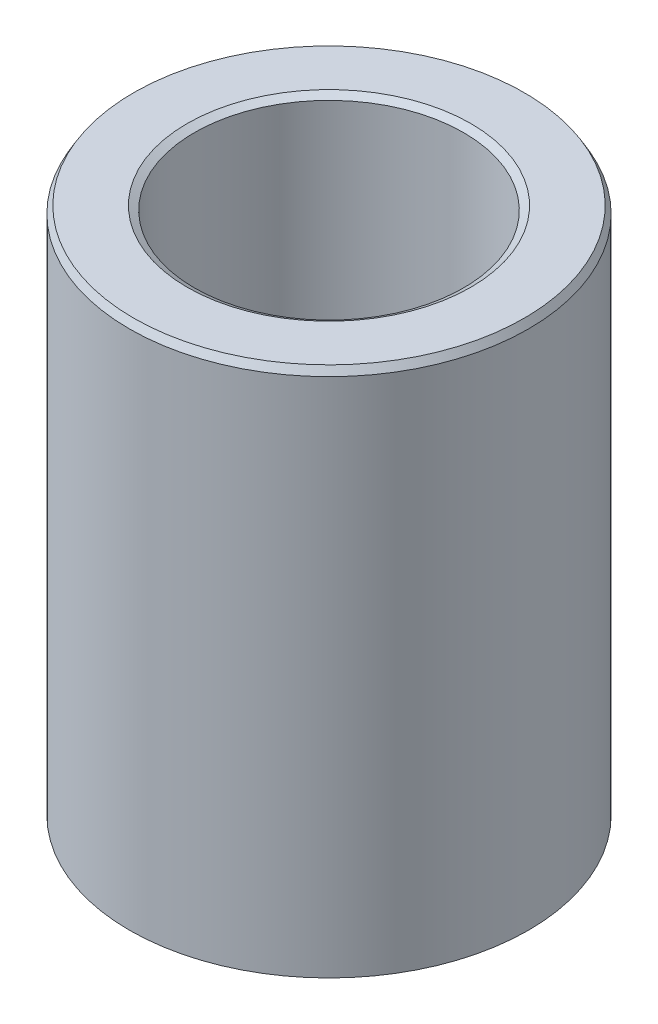
ISO-10303-21;
HEADER;
FILE_DESCRIPTION(('STEP AP214'),'2;1');
FILE_NAME('part.step','',(''),(''),'','','');
FILE_SCHEMA(('AUTOMOTIVE_DESIGN { 1 0 10303 214 1 1 1 1 }'));
ENDSEC;
DATA;
#1=APPLICATION_CONTEXT('core data for automotive mechanical design processes');
#2=APPLICATION_PROTOCOL_DEFINITION('international standard','automotive_design',2000,#1);
#3=PRODUCT_CONTEXT('',#1,'mechanical');
#4=PRODUCT('Part','Part','',(#3));
#5=PRODUCT_RELATED_PRODUCT_CATEGORY('part','',(#4));
#6=PRODUCT_DEFINITION_FORMATION('','',#4);
#7=PRODUCT_DEFINITION_CONTEXT('part definition',#1,'design');
#8=PRODUCT_DEFINITION('design','',#6,#7);
#9=PRODUCT_DEFINITION_SHAPE('','',#8);
#10=(LENGTH_UNIT() NAMED_UNIT(*) SI_UNIT(.MILLI.,.METRE.));
#11=(NAMED_UNIT(*) PLANE_ANGLE_UNIT() SI_UNIT($,.RADIAN.));
#12=(NAMED_UNIT(*) SI_UNIT($,.STERADIAN.) SOLID_ANGLE_UNIT());
#13=UNCERTAINTY_MEASURE_WITH_UNIT(LENGTH_MEASURE(1.E-05),#10,'distance_accuracy_value','');
#14=(GEOMETRIC_REPRESENTATION_CONTEXT(3) GLOBAL_UNCERTAINTY_ASSIGNED_CONTEXT((#13)) GLOBAL_UNIT_ASSIGNED_CONTEXT((#10,
#11,#12)) REPRESENTATION_CONTEXT('',''));
#15=CARTESIAN_POINT('',(0.,0.,0.));
#16=DIRECTION('',(0.,0.,1.));
#17=DIRECTION('',(1.,0.,0.));
#18=AXIS2_PLACEMENT_3D('',#15,#16,#17);
#19=CARTESIAN_POINT('',(0.,20.0076575660146,0.));
#20=DIRECTION('',(0.,-1.,0.));
#21=DIRECTION('',(0.,0.,-1.));
#22=AXIS2_PLACEMENT_3D('',#19,#20,#21);
#23=CYLINDRICAL_SURFACE('',#22,7.5);
#24=CARTESIAN_POINT('',(0.,0.157490835188026,0.));
#25=DIRECTION('',(0.,1.,0.));
#26=DIRECTION('',(0.,0.,1.));
#27=AXIS2_PLACEMENT_3D('',#24,#25,#26);
#28=CIRCLE('',#27,7.5);
#29=CARTESIAN_POINT('',(0.,0.157490835188026,7.5));
#30=VERTEX_POINT('',#29);
#31=EDGE_CURVE('E10',#30,#30,#28,.T.);
#32=ORIENTED_EDGE('',*,*,#31,.T.);
#33=EDGE_LOOP('',(#32));
#34=FACE_BOUND('',#33,.T.);
#35=CARTESIAN_POINT('',(0.,19.7348754377425,0.));
#36=DIRECTION('',(0.,1.,0.));
#37=DIRECTION('',(0.,0.,1.));
#38=AXIS2_PLACEMENT_3D('',#35,#36,#37);
#39=CIRCLE('',#38,7.5);
#40=CARTESIAN_POINT('',(0.,19.7348754377425,7.5));
#41=VERTEX_POINT('',#40);
#42=EDGE_CURVE('E50',#41,#41,#39,.F.);
#43=ORIENTED_EDGE('',*,*,#42,.T.);
#44=EDGE_LOOP('',(#43));
#45=FACE_BOUND('',#44,.T.);
#46=ADVANCED_FACE('F39',(#34,#45),#23,.T.);
#47=CARTESIAN_POINT('',(0.,20.0076575660146,0.));
#48=DIRECTION('',(0.,1.,0.));
#49=DIRECTION('',(0.,0.,1.));
#50=AXIS2_PLACEMENT_3D('',#47,#48,#49);
#51=PLANE('',#50);
#52=CARTESIAN_POINT('',(0.,20.0076575660146,0.));
#53=DIRECTION('',(0.,1.,0.));
#54=DIRECTION('',(0.,0.,1.));
#55=AXIS2_PLACEMENT_3D('',#52,#53,#54);
#56=CIRCLE('',#55,5.33244626798489);
#57=CARTESIAN_POINT('',(0.,20.0076575660146,5.33244626798489));
#58=VERTEX_POINT('',#57);
#59=EDGE_CURVE('E58',#58,#58,#56,.F.);
#60=ORIENTED_EDGE('',*,*,#59,.T.);
#61=EDGE_LOOP('',(#60));
#62=FACE_BOUND('',#61,.T.);
#63=CARTESIAN_POINT('',(0.,20.0076575660146,0.));
#64=DIRECTION('',(0.,1.,0.));
#65=DIRECTION('',(0.,0.,1.));
#66=AXIS2_PLACEMENT_3D('',#63,#64,#65);
#67=CIRCLE('',#66,7.34250916481197);
#68=CARTESIAN_POINT('',(0.,20.0076575660146,7.34250916481197));
#69=VERTEX_POINT('',#68);
#70=EDGE_CURVE('E61',#69,#69,#67,.T.);
#71=ORIENTED_EDGE('',*,*,#70,.T.);
#72=EDGE_LOOP('',(#71));
#73=FACE_BOUND('',#72,.T.);
#74=ADVANCED_FACE('F88',(#62,#73),#51,.T.);
#75=CARTESIAN_POINT('',(0.,0.,0.));
#76=DIRECTION('',(0.,1.,0.));
#77=DIRECTION('',(0.,0.,1.));
#78=AXIS2_PLACEMENT_3D('',#75,#76,#77);
#79=PLANE('',#78);
#80=CARTESIAN_POINT('',(0.,0.,0.));
#81=DIRECTION('',(0.,1.,0.));
#82=DIRECTION('',(0.,0.,1.));
#83=AXIS2_PLACEMENT_3D('',#80,#81,#82);
#84=CIRCLE('',#83,5.2171549749008);
#85=CARTESIAN_POINT('',(0.,0.,5.2171549749008));
#86=VERTEX_POINT('',#85);
#87=EDGE_CURVE('E51',#86,#86,#84,.T.);
#88=ORIENTED_EDGE('',*,*,#87,.T.);
#89=EDGE_LOOP('',(#88));
#90=FACE_BOUND('',#89,.T.);
#91=CARTESIAN_POINT('',(0.,0.,0.));
#92=DIRECTION('',(0.,1.,0.));
#93=DIRECTION('',(0.,0.,1.));
#94=AXIS2_PLACEMENT_3D('',#91,#92,#93);
#95=CIRCLE('',#94,7.22721787172788);
#96=CARTESIAN_POINT('',(0.,0.,7.22721787172788));
#97=VERTEX_POINT('',#96);
#98=EDGE_CURVE('E54',#97,#97,#95,.F.);
#99=ORIENTED_EDGE('',*,*,#98,.T.);
#100=EDGE_LOOP('',(#99));
#101=FACE_BOUND('',#100,.T.);
#102=ADVANCED_FACE('F83',(#90,#101),#79,.F.);
#103=CARTESIAN_POINT('',(0.,20.0076575660146,0.));
#104=DIRECTION('',(0.,-1.,0.));
#105=DIRECTION('',(0.,0.,-1.));
#106=AXIS2_PLACEMENT_3D('',#103,#104,#105);
#107=CYLINDRICAL_SURFACE('',#106,5.05966413971277);
#108=CARTESIAN_POINT('',(0.,19.8501667308266,0.));
#109=DIRECTION('',(0.,1.,0.));
#110=DIRECTION('',(0.,0.,1.));
#111=AXIS2_PLACEMENT_3D('',#108,#109,#110);
#112=CIRCLE('',#111,5.05966413971277);
#113=CARTESIAN_POINT('',(0.,19.8501667308266,5.05966413971277));
#114=VERTEX_POINT('',#113);
#115=EDGE_CURVE('E67',#114,#114,#112,.T.);
#116=ORIENTED_EDGE('',*,*,#115,.T.);
#117=EDGE_LOOP('',(#116));
#118=FACE_BOUND('',#117,.T.);
#119=CARTESIAN_POINT('',(0.,0.272782128272118,0.));
#120=DIRECTION('',(0.,1.,0.));
#121=DIRECTION('',(0.,0.,1.));
#122=AXIS2_PLACEMENT_3D('',#119,#120,#121);
#123=CIRCLE('',#122,5.05966413971277);
#124=CARTESIAN_POINT('',(0.,0.272782128272118,5.05966413971277));
#125=VERTEX_POINT('',#124);
#126=EDGE_CURVE('E69',#125,#125,#123,.F.);
#127=ORIENTED_EDGE('',*,*,#126,.T.);
#128=EDGE_LOOP('',(#127));
#129=FACE_BOUND('',#128,.T.);
#130=ADVANCED_FACE('F71',(#118,#129),#107,.F.);
#131=CARTESIAN_POINT('',(0.,19.8501667308266,0.));
#132=DIRECTION('',(0.,1.,0.));
#133=DIRECTION('',(0.,0.,1.));
#134=AXIS2_PLACEMENT_3D('',#131,#132,#133);
#135=CONICAL_SURFACE('',#134,5.05966413971277,1.0471975511966);
#136=ORIENTED_EDGE('',*,*,#59,.F.);
#137=EDGE_LOOP('',(#136));
#138=FACE_BOUND('',#137,.T.);
#139=ORIENTED_EDGE('',*,*,#115,.F.);
#140=EDGE_LOOP('',(#139));
#141=FACE_BOUND('',#140,.T.);
#142=ADVANCED_FACE('F77',(#138,#141),#135,.F.);
#143=CARTESIAN_POINT('',(0.,0.,0.));
#144=DIRECTION('',(0.,-1.,0.));
#145=DIRECTION('',(0.,0.,-1.));
#146=AXIS2_PLACEMENT_3D('',#143,#144,#145);
#147=CONICAL_SURFACE('',#146,5.2171549749008,0.523598775598291);
#148=ORIENTED_EDGE('',*,*,#126,.F.);
#149=EDGE_LOOP('',(#148));
#150=FACE_BOUND('',#149,.T.);
#151=ORIENTED_EDGE('',*,*,#87,.F.);
#152=EDGE_LOOP('',(#151));
#153=FACE_BOUND('',#152,.T.);
#154=ADVANCED_FACE('F73',(#150,#153),#147,.F.);
#155=CARTESIAN_POINT('',(0.,0.157490835188026,0.));
#156=DIRECTION('',(0.,1.,0.));
#157=DIRECTION('',(0.,0.,1.));
#158=AXIS2_PLACEMENT_3D('',#155,#156,#157);
#159=CONICAL_SURFACE('',#158,7.5,1.0471975511966);
#160=ORIENTED_EDGE('',*,*,#98,.F.);
#161=EDGE_LOOP('',(#160));
#162=FACE_BOUND('',#161,.T.);
#163=ORIENTED_EDGE('',*,*,#31,.F.);
#164=EDGE_LOOP('',(#163));
#165=FACE_BOUND('',#164,.T.);
#166=ADVANCED_FACE('F76',(#162,#165),#159,.T.);
#167=CARTESIAN_POINT('',(0.,20.0076575660146,0.));
#168=DIRECTION('',(0.,-1.,0.));
#169=DIRECTION('',(0.,0.,-1.));
#170=AXIS2_PLACEMENT_3D('',#167,#168,#169);
#171=CONICAL_SURFACE('',#170,7.34250916481197,0.523598775598297);
#172=ORIENTED_EDGE('',*,*,#42,.F.);
#173=EDGE_LOOP('',(#172));
#174=FACE_BOUND('',#173,.T.);
#175=ORIENTED_EDGE('',*,*,#70,.F.);
#176=EDGE_LOOP('',(#175));
#177=FACE_BOUND('',#176,.T.);
#178=ADVANCED_FACE('F45',(#174,#177),#171,.T.);
#179=CLOSED_SHELL('',(#46,#74,#102,#130,#142,#154,#166,#178));
#180=MANIFOLD_SOLID_BREP('B2',#179);
#181=ADVANCED_BREP_SHAPE_REPRESENTATION('',(#18,#180),#14);
#182=SHAPE_DEFINITION_REPRESENTATION(#9,#181);
ENDSEC;
END-ISO-10303-21;
